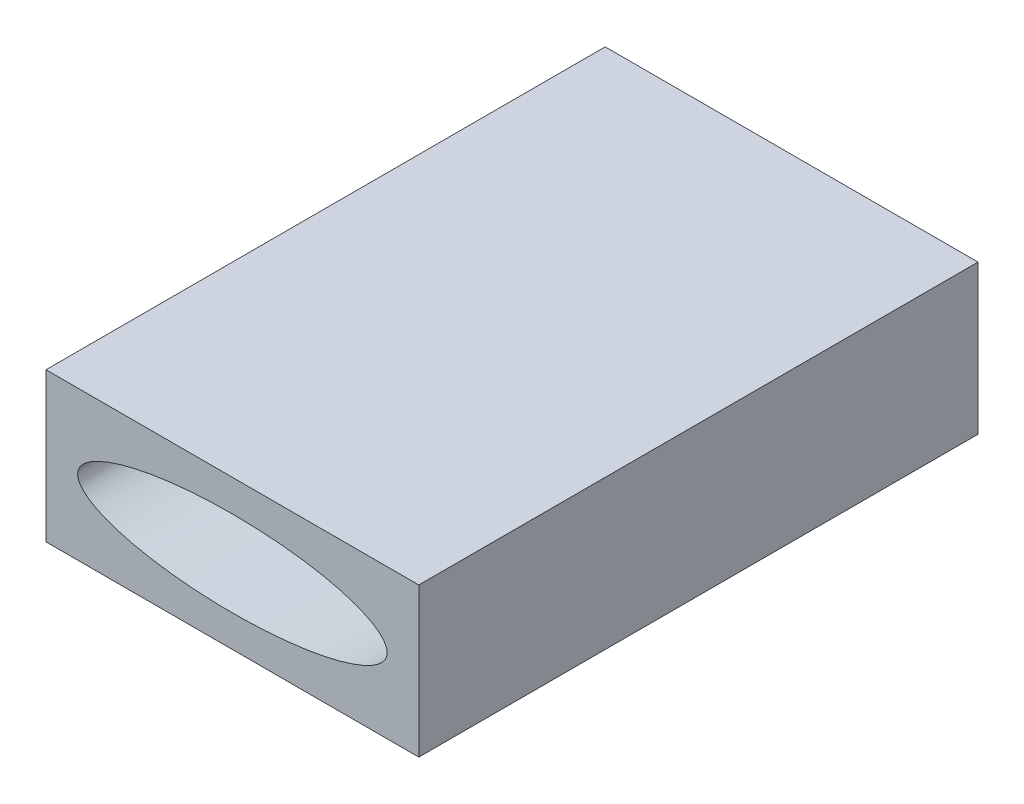
ISO-10303-21;
HEADER;
FILE_DESCRIPTION(('STEP AP214'),'2;1');
FILE_NAME('part.step','',(''),(''),'','','');
FILE_SCHEMA(('AUTOMOTIVE_DESIGN { 1 0 10303 214 1 1 1 1 }'));
ENDSEC;
DATA;
#1=APPLICATION_CONTEXT('core data for automotive mechanical design processes');
#2=APPLICATION_PROTOCOL_DEFINITION('international standard','automotive_design',2000,#1);
#3=PRODUCT_CONTEXT('',#1,'mechanical');
#4=PRODUCT('Part','Part','',(#3));
#5=PRODUCT_RELATED_PRODUCT_CATEGORY('part','',(#4));
#6=PRODUCT_DEFINITION_FORMATION('','',#4);
#7=PRODUCT_DEFINITION_CONTEXT('part definition',#1,'design');
#8=PRODUCT_DEFINITION('design','',#6,#7);
#9=PRODUCT_DEFINITION_SHAPE('','',#8);
#10=(LENGTH_UNIT() NAMED_UNIT(*) SI_UNIT(.MILLI.,.METRE.));
#11=(NAMED_UNIT(*) PLANE_ANGLE_UNIT() SI_UNIT($,.RADIAN.));
#12=(NAMED_UNIT(*) SI_UNIT($,.STERADIAN.) SOLID_ANGLE_UNIT());
#13=UNCERTAINTY_MEASURE_WITH_UNIT(LENGTH_MEASURE(1.E-05),#10,'distance_accuracy_value','');
#14=(GEOMETRIC_REPRESENTATION_CONTEXT(3) GLOBAL_UNCERTAINTY_ASSIGNED_CONTEXT((#13)) GLOBAL_UNIT_ASSIGNED_CONTEXT((#10,
#11,#12)) REPRESENTATION_CONTEXT('',''));
#15=CARTESIAN_POINT('',(0.,0.,0.));
#16=DIRECTION('',(0.,0.,1.));
#17=DIRECTION('',(1.,0.,0.));
#18=AXIS2_PLACEMENT_3D('',#15,#16,#17);
#19=CARTESIAN_POINT('',(0.,0.,-3000.));
#20=DIRECTION('',(-1.,0.,0.));
#21=DIRECTION('',(0.,0.,1.));
#22=AXIS2_PLACEMENT_3D('',#19,#20,#21);
#23=PLANE('',#22);
#24=DIRECTION('',(0.,-1.,0.));
#25=VECTOR('',#24,1.);
#26=CARTESIAN_POINT('',(0.,0.,0.));
#27=LINE('',#26,#25);
#28=CARTESIAN_POINT('',(0.,800.,0.));
#29=VERTEX_POINT('',#28);
#30=CARTESIAN_POINT('',(0.,0.,0.));
#31=VERTEX_POINT('',#30);
#32=EDGE_CURVE('E66',#29,#31,#27,.T.);
#33=ORIENTED_EDGE('',*,*,#32,.F.);
#34=DIRECTION('',(0.,0.,1.));
#35=VECTOR('',#34,1.);
#36=CARTESIAN_POINT('',(0.,800.,-3000.));
#37=LINE('',#36,#35);
#38=CARTESIAN_POINT('',(0.,800.,-3000.));
#39=VERTEX_POINT('',#38);
#40=EDGE_CURVE('E11',#39,#29,#37,.T.);
#41=ORIENTED_EDGE('',*,*,#40,.F.);
#42=DIRECTION('',(0.,-1.,0.));
#43=VECTOR('',#42,1.);
#44=CARTESIAN_POINT('',(0.,0.,-3000.));
#45=LINE('',#44,#43);
#46=CARTESIAN_POINT('',(0.,0.,-3000.));
#47=VERTEX_POINT('',#46);
#48=EDGE_CURVE('E68',#39,#47,#45,.T.);
#49=ORIENTED_EDGE('',*,*,#48,.T.);
#50=DIRECTION('',(0.,0.,1.));
#51=VECTOR('',#50,1.);
#52=CARTESIAN_POINT('',(0.,0.,-3000.));
#53=LINE('',#52,#51);
#54=EDGE_CURVE('E29',#47,#31,#53,.T.);
#55=ORIENTED_EDGE('',*,*,#54,.T.);
#56=EDGE_LOOP('',(#33,#41,#49,#55));
#57=FACE_BOUND('',#56,.T.);
#58=ADVANCED_FACE('F26',(#57),#23,.T.);
#59=CARTESIAN_POINT('',(0.,800.,-3000.));
#60=DIRECTION('',(0.,1.,0.));
#61=DIRECTION('',(0.,0.,1.));
#62=AXIS2_PLACEMENT_3D('',#59,#60,#61);
#63=PLANE('',#62);
#64=DIRECTION('',(-1.,0.,0.));
#65=VECTOR('',#64,1.);
#66=CARTESIAN_POINT('',(0.,800.,0.));
#67=LINE('',#66,#65);
#68=CARTESIAN_POINT('',(2000.,800.,0.));
#69=VERTEX_POINT('',#68);
#70=EDGE_CURVE('E83',#69,#29,#67,.T.);
#71=ORIENTED_EDGE('',*,*,#70,.F.);
#72=DIRECTION('',(0.,0.,1.));
#73=VECTOR('',#72,1.);
#74=CARTESIAN_POINT('',(2000.,800.,-3000.));
#75=LINE('',#74,#73);
#76=CARTESIAN_POINT('',(2000.,800.,-3000.));
#77=VERTEX_POINT('',#76);
#78=EDGE_CURVE('E34',#77,#69,#75,.T.);
#79=ORIENTED_EDGE('',*,*,#78,.F.);
#80=DIRECTION('',(-1.,0.,0.));
#81=VECTOR('',#80,1.);
#82=CARTESIAN_POINT('',(0.,800.,-3000.));
#83=LINE('',#82,#81);
#84=EDGE_CURVE('E73',#77,#39,#83,.T.);
#85=ORIENTED_EDGE('',*,*,#84,.T.);
#86=ORIENTED_EDGE('',*,*,#40,.T.);
#87=EDGE_LOOP('',(#71,#79,#85,#86));
#88=FACE_BOUND('',#87,.T.);
#89=ADVANCED_FACE('F104',(#88),#63,.T.);
#90=CARTESIAN_POINT('',(2000.,0.,-3000.));
#91=DIRECTION('',(1.,0.,0.));
#92=DIRECTION('',(0.,0.,-1.));
#93=AXIS2_PLACEMENT_3D('',#90,#91,#92);
#94=PLANE('',#93);
#95=DIRECTION('',(0.,1.,0.));
#96=VECTOR('',#95,1.);
#97=CARTESIAN_POINT('',(2000.,0.,0.));
#98=LINE('',#97,#96);
#99=CARTESIAN_POINT('',(2000.,0.,0.));
#100=VERTEX_POINT('',#99);
#101=EDGE_CURVE('E80',#100,#69,#98,.T.);
#102=ORIENTED_EDGE('',*,*,#101,.F.);
#103=DIRECTION('',(0.,0.,1.));
#104=VECTOR('',#103,1.);
#105=CARTESIAN_POINT('',(2000.,0.,-3000.));
#106=LINE('',#105,#104);
#107=CARTESIAN_POINT('',(2000.,0.,-3000.));
#108=VERTEX_POINT('',#107);
#109=EDGE_CURVE('E72',#108,#100,#106,.T.);
#110=ORIENTED_EDGE('',*,*,#109,.F.);
#111=DIRECTION('',(0.,1.,0.));
#112=VECTOR('',#111,1.);
#113=CARTESIAN_POINT('',(2000.,0.,-3000.));
#114=LINE('',#113,#112);
#115=EDGE_CURVE('E97',#108,#77,#114,.T.);
#116=ORIENTED_EDGE('',*,*,#115,.T.);
#117=ORIENTED_EDGE('',*,*,#78,.T.);
#118=EDGE_LOOP('',(#102,#110,#116,#117));
#119=FACE_BOUND('',#118,.T.);
#120=ADVANCED_FACE('F101',(#119),#94,.T.);
#121=CARTESIAN_POINT('',(0.,0.,-3000.));
#122=DIRECTION('',(0.,-1.,0.));
#123=DIRECTION('',(0.,0.,-1.));
#124=AXIS2_PLACEMENT_3D('',#121,#122,#123);
#125=PLANE('',#124);
#126=DIRECTION('',(1.,0.,0.));
#127=VECTOR('',#126,1.);
#128=CARTESIAN_POINT('',(0.,0.,0.));
#129=LINE('',#128,#127);
#130=EDGE_CURVE('E75',#31,#100,#129,.T.);
#131=ORIENTED_EDGE('',*,*,#130,.F.);
#132=ORIENTED_EDGE('',*,*,#54,.F.);
#133=DIRECTION('',(1.,0.,0.));
#134=VECTOR('',#133,1.);
#135=CARTESIAN_POINT('',(0.,0.,-3000.));
#136=LINE('',#135,#134);
#137=EDGE_CURVE('E95',#47,#108,#136,.T.);
#138=ORIENTED_EDGE('',*,*,#137,.T.);
#139=ORIENTED_EDGE('',*,*,#109,.T.);
#140=EDGE_LOOP('',(#131,#132,#138,#139));
#141=FACE_BOUND('',#140,.T.);
#142=ADVANCED_FACE('F76',(#141),#125,.T.);
#143=CARTESIAN_POINT('',(0.,800.,-3000.));
#144=DIRECTION('',(0.,0.,-1.));
#145=DIRECTION('',(-1.,0.,0.));
#146=AXIS2_PLACEMENT_3D('',#143,#144,#145);
#147=PLANE('',#146);
#148=CARTESIAN_POINT('',(1000.,400.,-3000.));
#149=DIRECTION('',(0.,0.,1.));
#150=DIRECTION('',(-1.,0.,0.));
#151=AXIS2_PLACEMENT_3D('',#148,#149,#150);
#152=ELLIPSE('',#151,830.,230.);
#153=CARTESIAN_POINT('',(170.,400.,-3000.));
#154=VERTEX_POINT('',#153);
#155=EDGE_CURVE('E84',#154,#154,#152,.T.);
#156=ORIENTED_EDGE('',*,*,#155,.T.);
#157=EDGE_LOOP('',(#156));
#158=FACE_BOUND('',#157,.T.);
#159=ORIENTED_EDGE('',*,*,#48,.F.);
#160=ORIENTED_EDGE('',*,*,#84,.F.);
#161=ORIENTED_EDGE('',*,*,#115,.F.);
#162=ORIENTED_EDGE('',*,*,#137,.F.);
#163=EDGE_LOOP('',(#159,#160,#161,#162));
#164=FACE_BOUND('',#163,.T.);
#165=ADVANCED_FACE('F106',(#158,#164),#147,.T.);
#166=CARTESIAN_POINT('',(0.,800.,0.));
#167=DIRECTION('',(0.,0.,-1.));
#168=DIRECTION('',(-1.,0.,0.));
#169=AXIS2_PLACEMENT_3D('',#166,#167,#168);
#170=PLANE('',#169);
#171=CARTESIAN_POINT('',(1000.,400.,0.));
#172=DIRECTION('',(0.,0.,1.));
#173=DIRECTION('',(-1.,0.,0.));
#174=AXIS2_PLACEMENT_3D('',#171,#172,#173);
#175=ELLIPSE('',#174,830.,230.);
#176=CARTESIAN_POINT('',(170.,400.,0.));
#177=VERTEX_POINT('',#176);
#178=EDGE_CURVE('E87',#177,#177,#175,.T.);
#179=ORIENTED_EDGE('',*,*,#178,.F.);
#180=EDGE_LOOP('',(#179));
#181=FACE_BOUND('',#180,.T.);
#182=ORIENTED_EDGE('',*,*,#32,.T.);
#183=ORIENTED_EDGE('',*,*,#130,.T.);
#184=ORIENTED_EDGE('',*,*,#101,.T.);
#185=ORIENTED_EDGE('',*,*,#70,.T.);
#186=EDGE_LOOP('',(#182,#183,#184,#185));
#187=FACE_BOUND('',#186,.T.);
#188=ADVANCED_FACE('F82',(#181,#187),#170,.F.);
#189=DIRECTION('',(0.,0.,1.));
#190=VECTOR('',#189,1.);
#191=SURFACE_OF_LINEAR_EXTRUSION('',#152,#190);
#192=ORIENTED_EDGE('',*,*,#155,.F.);
#193=EDGE_LOOP('',(#192));
#194=FACE_BOUND('',#193,.T.);
#195=ORIENTED_EDGE('',*,*,#178,.T.);
#196=EDGE_LOOP('',(#195));
#197=FACE_BOUND('',#196,.T.);
#198=ADVANCED_FACE('F114',(#194,#197),#191,.F.);
#199=CLOSED_SHELL('',(#58,#89,#120,#142,#165,#188,#198));
#200=MANIFOLD_SOLID_BREP('B2',#199);
#201=ADVANCED_BREP_SHAPE_REPRESENTATION('',(#18,#200),#14);
#202=SHAPE_DEFINITION_REPRESENTATION(#9,#201);
ENDSEC;
END-ISO-10303-21;
